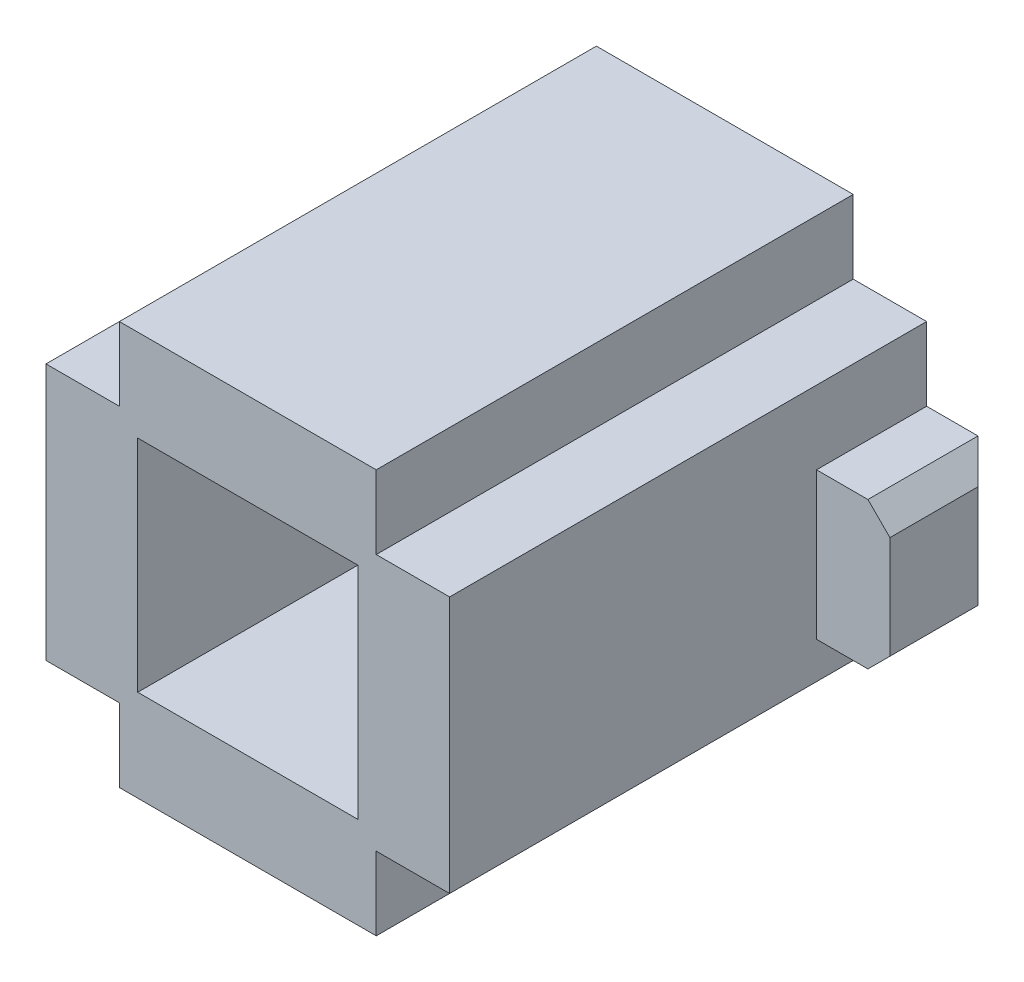
ISO-10303-21;
HEADER;
FILE_DESCRIPTION(('STEP AP214'),'2;1');
FILE_NAME('part.step','',(''),(''),'','','');
FILE_SCHEMA(('AUTOMOTIVE_DESIGN { 1 0 10303 214 1 1 1 1 }'));
ENDSEC;
DATA;
#1=APPLICATION_CONTEXT('core data for automotive mechanical design processes');
#2=APPLICATION_PROTOCOL_DEFINITION('international standard','automotive_design',2000,#1);
#3=PRODUCT_CONTEXT('',#1,'mechanical');
#4=PRODUCT('Part','Part','',(#3));
#5=PRODUCT_RELATED_PRODUCT_CATEGORY('part','',(#4));
#6=PRODUCT_DEFINITION_FORMATION('','',#4);
#7=PRODUCT_DEFINITION_CONTEXT('part definition',#1,'design');
#8=PRODUCT_DEFINITION('design','',#6,#7);
#9=PRODUCT_DEFINITION_SHAPE('','',#8);
#10=(LENGTH_UNIT() NAMED_UNIT(*) SI_UNIT(.MILLI.,.METRE.));
#11=(NAMED_UNIT(*) PLANE_ANGLE_UNIT() SI_UNIT($,.RADIAN.));
#12=(NAMED_UNIT(*) SI_UNIT($,.STERADIAN.) SOLID_ANGLE_UNIT());
#13=UNCERTAINTY_MEASURE_WITH_UNIT(LENGTH_MEASURE(1.E-05),#10,'distance_accuracy_value','');
#14=(GEOMETRIC_REPRESENTATION_CONTEXT(3) GLOBAL_UNCERTAINTY_ASSIGNED_CONTEXT((#13)) GLOBAL_UNIT_ASSIGNED_CONTEXT((#10,
#11,#12)) REPRESENTATION_CONTEXT('',''));
#15=CARTESIAN_POINT('',(0.,0.,0.));
#16=DIRECTION('',(0.,0.,1.));
#17=DIRECTION('',(1.,0.,0.));
#18=AXIS2_PLACEMENT_3D('',#15,#16,#17);
#19=CARTESIAN_POINT('',(27.5,17.5,32.5));
#20=DIRECTION('',(-1.,0.,0.));
#21=DIRECTION('',(0.,-1.,0.));
#22=AXIS2_PLACEMENT_3D('',#19,#20,#21);
#23=PLANE('',#22);
#24=DIRECTION('',(0.,0.,-1.));
#25=VECTOR('',#24,1.);
#26=CARTESIAN_POINT('',(27.5,-12.5,-32.5));
#27=LINE('',#26,#25);
#28=CARTESIAN_POINT('',(27.5,-12.5,-17.5));
#29=VERTEX_POINT('',#28);
#30=CARTESIAN_POINT('',(27.5,-12.5,-32.5));
#31=VERTEX_POINT('',#30);
#32=EDGE_CURVE('E197',#29,#31,#27,.T.);
#33=ORIENTED_EDGE('',*,*,#32,.F.);
#34=DIRECTION('',(0.,-1.,0.));
#35=VECTOR('',#34,1.);
#36=CARTESIAN_POINT('',(27.5,7.50000000000001,-17.5));
#37=LINE('',#36,#35);
#38=CARTESIAN_POINT('',(27.5,7.50000000000001,-17.5));
#39=VERTEX_POINT('',#38);
#40=EDGE_CURVE('E185',#39,#29,#37,.T.);
#41=ORIENTED_EDGE('',*,*,#40,.F.);
#42=DIRECTION('',(0.,0.,1.));
#43=VECTOR('',#42,1.);
#44=CARTESIAN_POINT('',(27.5,7.50000000000001,-32.5));
#45=LINE('',#44,#43);
#46=CARTESIAN_POINT('',(27.5,7.50000000000001,-32.5));
#47=VERTEX_POINT('',#46);
#48=EDGE_CURVE('E193',#47,#39,#45,.T.);
#49=ORIENTED_EDGE('',*,*,#48,.F.);
#50=DIRECTION('',(0.,1.,0.));
#51=VECTOR('',#50,1.);
#52=CARTESIAN_POINT('',(27.5,17.5,-32.5));
#53=LINE('',#52,#51);
#54=CARTESIAN_POINT('',(27.5,17.5,-32.5));
#55=VERTEX_POINT('',#54);
#56=EDGE_CURVE('E286',#47,#55,#53,.T.);
#57=ORIENTED_EDGE('',*,*,#56,.T.);
#58=DIRECTION('',(0.,0.,-1.));
#59=VECTOR('',#58,1.);
#60=CARTESIAN_POINT('',(27.5,17.5,32.5));
#61=LINE('',#60,#59);
#62=CARTESIAN_POINT('',(27.5,17.5,32.5));
#63=VERTEX_POINT('',#62);
#64=EDGE_CURVE('E302',#63,#55,#61,.T.);
#65=ORIENTED_EDGE('',*,*,#64,.F.);
#66=DIRECTION('',(0.,1.,0.));
#67=VECTOR('',#66,1.);
#68=CARTESIAN_POINT('',(27.5,17.5,32.5));
#69=LINE('',#68,#67);
#70=CARTESIAN_POINT('',(27.5,-17.5,32.5));
#71=VERTEX_POINT('',#70);
#72=EDGE_CURVE('E261',#71,#63,#69,.T.);
#73=ORIENTED_EDGE('',*,*,#72,.F.);
#74=DIRECTION('',(0.,0.,-1.));
#75=VECTOR('',#74,1.);
#76=CARTESIAN_POINT('',(27.5,-17.5,32.5));
#77=LINE('',#76,#75);
#78=CARTESIAN_POINT('',(27.5,-17.5,-32.5));
#79=VERTEX_POINT('',#78);
#80=EDGE_CURVE('E305',#71,#79,#77,.T.);
#81=ORIENTED_EDGE('',*,*,#80,.T.);
#82=EDGE_CURVE('E287',#79,#31,#53,.T.);
#83=ORIENTED_EDGE('',*,*,#82,.T.);
#84=EDGE_LOOP('',(#33,#41,#49,#57,#65,#73,#81,#83));
#85=FACE_BOUND('',#84,.T.);
#86=ADVANCED_FACE('F33',(#85),#23,.F.);
#87=CARTESIAN_POINT('',(0.,0.,32.5));
#88=DIRECTION('',(0.,0.,-1.));
#89=DIRECTION('',(-1.,0.,0.));
#90=AXIS2_PLACEMENT_3D('',#87,#88,#89);
#91=PLANE('',#90);
#92=DIRECTION('',(0.,-1.,0.));
#93=VECTOR('',#92,1.);
#94=CARTESIAN_POINT('',(-17.5,27.5,32.5));
#95=LINE('',#94,#93);
#96=CARTESIAN_POINT('',(-17.5,27.5,32.5));
#97=VERTEX_POINT('',#96);
#98=CARTESIAN_POINT('',(-17.5,17.5,32.5));
#99=VERTEX_POINT('',#98);
#100=EDGE_CURVE('E243',#97,#99,#95,.T.);
#101=ORIENTED_EDGE('',*,*,#100,.T.);
#102=DIRECTION('',(-1.,0.,0.));
#103=VECTOR('',#102,1.);
#104=CARTESIAN_POINT('',(-17.5,17.5,32.5));
#105=LINE('',#104,#103);
#106=CARTESIAN_POINT('',(-27.5,17.5,32.5));
#107=VERTEX_POINT('',#106);
#108=EDGE_CURVE('E246',#99,#107,#105,.T.);
#109=ORIENTED_EDGE('',*,*,#108,.T.);
#110=DIRECTION('',(0.,-1.,0.));
#111=VECTOR('',#110,1.);
#112=CARTESIAN_POINT('',(-27.5,17.5,32.5));
#113=LINE('',#112,#111);
#114=CARTESIAN_POINT('',(-27.5,-17.5,32.5));
#115=VERTEX_POINT('',#114);
#116=EDGE_CURVE('E249',#107,#115,#113,.T.);
#117=ORIENTED_EDGE('',*,*,#116,.T.);
#118=DIRECTION('',(1.,0.,0.));
#119=VECTOR('',#118,1.);
#120=CARTESIAN_POINT('',(-27.5,-17.5,32.5));
#121=LINE('',#120,#119);
#122=CARTESIAN_POINT('',(-17.5,-17.5,32.5));
#123=VERTEX_POINT('',#122);
#124=EDGE_CURVE('E251',#115,#123,#121,.T.);
#125=ORIENTED_EDGE('',*,*,#124,.T.);
#126=DIRECTION('',(0.,-1.,0.));
#127=VECTOR('',#126,1.);
#128=CARTESIAN_POINT('',(-17.5,-17.5,32.5));
#129=LINE('',#128,#127);
#130=CARTESIAN_POINT('',(-17.5,-27.5,32.5));
#131=VERTEX_POINT('',#130);
#132=EDGE_CURVE('E253',#123,#131,#129,.T.);
#133=ORIENTED_EDGE('',*,*,#132,.T.);
#134=DIRECTION('',(1.,0.,0.));
#135=VECTOR('',#134,1.);
#136=CARTESIAN_POINT('',(-17.5,-27.5,32.5));
#137=LINE('',#136,#135);
#138=CARTESIAN_POINT('',(17.5,-27.5,32.5));
#139=VERTEX_POINT('',#138);
#140=EDGE_CURVE('E255',#131,#139,#137,.T.);
#141=ORIENTED_EDGE('',*,*,#140,.T.);
#142=DIRECTION('',(0.,1.,0.));
#143=VECTOR('',#142,1.);
#144=CARTESIAN_POINT('',(17.5,-17.5,32.5));
#145=LINE('',#144,#143);
#146=CARTESIAN_POINT('',(17.5,-17.5,32.5));
#147=VERTEX_POINT('',#146);
#148=EDGE_CURVE('E257',#139,#147,#145,.T.);
#149=ORIENTED_EDGE('',*,*,#148,.T.);
#150=DIRECTION('',(1.,0.,0.));
#151=VECTOR('',#150,1.);
#152=CARTESIAN_POINT('',(27.5,-17.5,32.5));
#153=LINE('',#152,#151);
#154=EDGE_CURVE('E259',#147,#71,#153,.T.);
#155=ORIENTED_EDGE('',*,*,#154,.T.);
#156=ORIENTED_EDGE('',*,*,#72,.T.);
#157=DIRECTION('',(-1.,0.,0.));
#158=VECTOR('',#157,1.);
#159=CARTESIAN_POINT('',(17.5,17.5,32.5));
#160=LINE('',#159,#158);
#161=CARTESIAN_POINT('',(17.5,17.5,32.5));
#162=VERTEX_POINT('',#161);
#163=EDGE_CURVE('E263',#63,#162,#160,.T.);
#164=ORIENTED_EDGE('',*,*,#163,.T.);
#165=DIRECTION('',(0.,1.,0.));
#166=VECTOR('',#165,1.);
#167=CARTESIAN_POINT('',(17.5,27.5,32.5));
#168=LINE('',#167,#166);
#169=CARTESIAN_POINT('',(17.5,27.5,32.5));
#170=VERTEX_POINT('',#169);
#171=EDGE_CURVE('E265',#162,#170,#168,.T.);
#172=ORIENTED_EDGE('',*,*,#171,.T.);
#173=DIRECTION('',(-1.,0.,0.));
#174=VECTOR('',#173,1.);
#175=CARTESIAN_POINT('',(-17.5,27.5,32.5));
#176=LINE('',#175,#174);
#177=EDGE_CURVE('E267',#170,#97,#176,.T.);
#178=ORIENTED_EDGE('',*,*,#177,.T.);
#179=EDGE_LOOP('',(#101,#109,#117,#125,#133,#141,#149,#155,#156,#164,#172,#178));
#180=FACE_BOUND('',#179,.T.);
#181=DIRECTION('',(0.,-1.,0.));
#182=VECTOR('',#181,1.);
#183=CARTESIAN_POINT('',(-15.,15.,32.5));
#184=LINE('',#183,#182);
#185=CARTESIAN_POINT('',(-15.,15.,32.5));
#186=VERTEX_POINT('',#185);
#187=CARTESIAN_POINT('',(-15.,-15.,32.5));
#188=VERTEX_POINT('',#187);
#189=EDGE_CURVE('E212',#186,#188,#184,.T.);
#190=ORIENTED_EDGE('',*,*,#189,.F.);
#191=DIRECTION('',(-1.,0.,0.));
#192=VECTOR('',#191,1.);
#193=CARTESIAN_POINT('',(-15.,15.,32.5));
#194=LINE('',#193,#192);
#195=CARTESIAN_POINT('',(15.,15.,32.5));
#196=VERTEX_POINT('',#195);
#197=EDGE_CURVE('E220',#196,#186,#194,.T.);
#198=ORIENTED_EDGE('',*,*,#197,.F.);
#199=DIRECTION('',(0.,1.,0.));
#200=VECTOR('',#199,1.);
#201=CARTESIAN_POINT('',(15.,15.,32.5));
#202=LINE('',#201,#200);
#203=CARTESIAN_POINT('',(15.,-15.,32.5));
#204=VERTEX_POINT('',#203);
#205=EDGE_CURVE('E217',#204,#196,#202,.T.);
#206=ORIENTED_EDGE('',*,*,#205,.F.);
#207=DIRECTION('',(1.,0.,0.));
#208=VECTOR('',#207,1.);
#209=CARTESIAN_POINT('',(-15.,-15.,32.5));
#210=LINE('',#209,#208);
#211=EDGE_CURVE('E214',#188,#204,#210,.T.);
#212=ORIENTED_EDGE('',*,*,#211,.F.);
#213=EDGE_LOOP('',(#190,#198,#206,#212));
#214=FACE_BOUND('',#213,.T.);
#215=ADVANCED_FACE('F373',(#180,#214),#91,.F.);
#216=CARTESIAN_POINT('',(0.,0.,-32.5));
#217=DIRECTION('',(0.,0.,-1.));
#218=DIRECTION('',(-1.,0.,0.));
#219=AXIS2_PLACEMENT_3D('',#216,#217,#218);
#220=PLANE('',#219);
#221=DIRECTION('',(-1.,0.,0.));
#222=VECTOR('',#221,1.);
#223=CARTESIAN_POINT('',(37.5,7.50000000000001,-32.5));
#224=LINE('',#223,#222);
#225=CARTESIAN_POINT('',(34.5,7.50000000000001,-32.5));
#226=VERTEX_POINT('',#225);
#227=EDGE_CURVE('E187',#226,#47,#224,.T.);
#228=ORIENTED_EDGE('',*,*,#227,.F.);
#229=DIRECTION('',(0.,-1.,0.));
#230=VECTOR('',#229,1.);
#231=CARTESIAN_POINT('',(34.5,-12.5,-32.5));
#232=LINE('',#231,#230);
#233=CARTESIAN_POINT('',(34.5,-12.5,-32.5));
#234=VERTEX_POINT('',#233);
#235=EDGE_CURVE('E42',#226,#234,#232,.T.);
#236=ORIENTED_EDGE('',*,*,#235,.T.);
#237=DIRECTION('',(-1.,0.,0.));
#238=VECTOR('',#237,1.);
#239=CARTESIAN_POINT('',(37.5,-12.5,-32.5));
#240=LINE('',#239,#238);
#241=EDGE_CURVE('E207',#234,#31,#240,.T.);
#242=ORIENTED_EDGE('',*,*,#241,.T.);
#243=ORIENTED_EDGE('',*,*,#82,.F.);
#244=DIRECTION('',(1.,0.,0.));
#245=VECTOR('',#244,1.);
#246=CARTESIAN_POINT('',(27.5,-17.5,-32.5));
#247=LINE('',#246,#245);
#248=CARTESIAN_POINT('',(17.5,-17.5,-32.5));
#249=VERTEX_POINT('',#248);
#250=EDGE_CURVE('E284',#249,#79,#247,.T.);
#251=ORIENTED_EDGE('',*,*,#250,.F.);
#252=DIRECTION('',(0.,1.,0.));
#253=VECTOR('',#252,1.);
#254=CARTESIAN_POINT('',(17.5,-17.5,-32.5));
#255=LINE('',#254,#253);
#256=CARTESIAN_POINT('',(17.5,-27.5,-32.5));
#257=VERTEX_POINT('',#256);
#258=EDGE_CURVE('E282',#257,#249,#255,.T.);
#259=ORIENTED_EDGE('',*,*,#258,.F.);
#260=DIRECTION('',(1.,0.,0.));
#261=VECTOR('',#260,1.);
#262=CARTESIAN_POINT('',(-17.5,-27.5,-32.5));
#263=LINE('',#262,#261);
#264=CARTESIAN_POINT('',(-17.5,-27.5,-32.5));
#265=VERTEX_POINT('',#264);
#266=EDGE_CURVE('E280',#265,#257,#263,.T.);
#267=ORIENTED_EDGE('',*,*,#266,.F.);
#268=DIRECTION('',(0.,-1.,0.));
#269=VECTOR('',#268,1.);
#270=CARTESIAN_POINT('',(-17.5,-17.5,-32.5));
#271=LINE('',#270,#269);
#272=CARTESIAN_POINT('',(-17.5,-17.5,-32.5));
#273=VERTEX_POINT('',#272);
#274=EDGE_CURVE('E278',#273,#265,#271,.T.);
#275=ORIENTED_EDGE('',*,*,#274,.F.);
#276=DIRECTION('',(1.,0.,0.));
#277=VECTOR('',#276,1.);
#278=CARTESIAN_POINT('',(-27.5,-17.5,-32.5));
#279=LINE('',#278,#277);
#280=CARTESIAN_POINT('',(-27.5,-17.5,-32.5));
#281=VERTEX_POINT('',#280);
#282=EDGE_CURVE('E276',#281,#273,#279,.T.);
#283=ORIENTED_EDGE('',*,*,#282,.F.);
#284=DIRECTION('',(0.,-1.,0.));
#285=VECTOR('',#284,1.);
#286=CARTESIAN_POINT('',(-27.5,17.5,-32.5));
#287=LINE('',#286,#285);
#288=CARTESIAN_POINT('',(-27.5,17.5,-32.5));
#289=VERTEX_POINT('',#288);
#290=EDGE_CURVE('E274',#289,#281,#287,.T.);
#291=ORIENTED_EDGE('',*,*,#290,.F.);
#292=DIRECTION('',(-1.,0.,0.));
#293=VECTOR('',#292,1.);
#294=CARTESIAN_POINT('',(-17.5,17.5,-32.5));
#295=LINE('',#294,#293);
#296=CARTESIAN_POINT('',(-17.5,17.5,-32.5));
#297=VERTEX_POINT('',#296);
#298=EDGE_CURVE('E272',#297,#289,#295,.T.);
#299=ORIENTED_EDGE('',*,*,#298,.F.);
#300=DIRECTION('',(0.,-1.,0.));
#301=VECTOR('',#300,1.);
#302=CARTESIAN_POINT('',(-17.5,27.5,-32.5));
#303=LINE('',#302,#301);
#304=CARTESIAN_POINT('',(-17.5,27.5,-32.5));
#305=VERTEX_POINT('',#304);
#306=EDGE_CURVE('E242',#305,#297,#303,.T.);
#307=ORIENTED_EDGE('',*,*,#306,.F.);
#308=DIRECTION('',(-1.,0.,0.));
#309=VECTOR('',#308,1.);
#310=CARTESIAN_POINT('',(-17.5,27.5,-32.5));
#311=LINE('',#310,#309);
#312=CARTESIAN_POINT('',(17.5,27.5,-32.5));
#313=VERTEX_POINT('',#312);
#314=EDGE_CURVE('E247',#313,#305,#311,.T.);
#315=ORIENTED_EDGE('',*,*,#314,.F.);
#316=DIRECTION('',(0.,1.,0.));
#317=VECTOR('',#316,1.);
#318=CARTESIAN_POINT('',(17.5,27.5,-32.5));
#319=LINE('',#318,#317);
#320=CARTESIAN_POINT('',(17.5,17.5,-32.5));
#321=VERTEX_POINT('',#320);
#322=EDGE_CURVE('E291',#321,#313,#319,.T.);
#323=ORIENTED_EDGE('',*,*,#322,.F.);
#324=DIRECTION('',(-1.,0.,0.));
#325=VECTOR('',#324,1.);
#326=CARTESIAN_POINT('',(17.5,17.5,-32.5));
#327=LINE('',#326,#325);
#328=EDGE_CURVE('E289',#55,#321,#327,.T.);
#329=ORIENTED_EDGE('',*,*,#328,.F.);
#330=ORIENTED_EDGE('',*,*,#56,.F.);
#331=EDGE_LOOP('',(#228,#236,#242,#243,#251,#259,#267,#275,#283,#291,#299,#307,#315,#323,#329,#330));
#332=FACE_BOUND('',#331,.T.);
#333=DIRECTION('',(-1.,0.,0.));
#334=VECTOR('',#333,1.);
#335=CARTESIAN_POINT('',(-15.,15.,-32.5));
#336=LINE('',#335,#334);
#337=CARTESIAN_POINT('',(15.,15.,-32.5));
#338=VERTEX_POINT('',#337);
#339=CARTESIAN_POINT('',(-15.,15.,-32.5));
#340=VERTEX_POINT('',#339);
#341=EDGE_CURVE('E215',#338,#340,#336,.T.);
#342=ORIENTED_EDGE('',*,*,#341,.T.);
#343=DIRECTION('',(0.,-1.,0.));
#344=VECTOR('',#343,1.);
#345=CARTESIAN_POINT('',(-15.,15.,-32.5));
#346=LINE('',#345,#344);
#347=CARTESIAN_POINT('',(-15.,-15.,-32.5));
#348=VERTEX_POINT('',#347);
#349=EDGE_CURVE('E211',#340,#348,#346,.T.);
#350=ORIENTED_EDGE('',*,*,#349,.T.);
#351=DIRECTION('',(1.,0.,0.));
#352=VECTOR('',#351,1.);
#353=CARTESIAN_POINT('',(-15.,-15.,-32.5));
#354=LINE('',#353,#352);
#355=CARTESIAN_POINT('',(15.,-15.,-32.5));
#356=VERTEX_POINT('',#355);
#357=EDGE_CURVE('E225',#348,#356,#354,.T.);
#358=ORIENTED_EDGE('',*,*,#357,.T.);
#359=DIRECTION('',(0.,1.,0.));
#360=VECTOR('',#359,1.);
#361=CARTESIAN_POINT('',(15.,15.,-32.5));
#362=LINE('',#361,#360);
#363=EDGE_CURVE('E228',#356,#338,#362,.T.);
#364=ORIENTED_EDGE('',*,*,#363,.T.);
#365=EDGE_LOOP('',(#342,#350,#358,#364));
#366=FACE_BOUND('',#365,.T.);
#367=ADVANCED_FACE('F359',(#332,#366),#220,.T.);
#368=CARTESIAN_POINT('',(-17.5,27.5,32.5));
#369=DIRECTION('',(1.,0.,0.));
#370=DIRECTION('',(0.,1.,0.));
#371=AXIS2_PLACEMENT_3D('',#368,#369,#370);
#372=PLANE('',#371);
#373=ORIENTED_EDGE('',*,*,#306,.T.);
#374=DIRECTION('',(0.,0.,-1.));
#375=VECTOR('',#374,1.);
#376=CARTESIAN_POINT('',(-17.5,17.5,32.5));
#377=LINE('',#376,#375);
#378=EDGE_CURVE('E326',#99,#297,#377,.T.);
#379=ORIENTED_EDGE('',*,*,#378,.F.);
#380=ORIENTED_EDGE('',*,*,#100,.F.);
#381=DIRECTION('',(0.,0.,-1.));
#382=VECTOR('',#381,1.);
#383=CARTESIAN_POINT('',(-17.5,27.5,32.5));
#384=LINE('',#383,#382);
#385=EDGE_CURVE('E269',#97,#305,#384,.T.);
#386=ORIENTED_EDGE('',*,*,#385,.T.);
#387=EDGE_LOOP('',(#373,#379,#380,#386));
#388=FACE_BOUND('',#387,.T.);
#389=ADVANCED_FACE('F413',(#388),#372,.F.);
#390=CARTESIAN_POINT('',(-17.5,17.5,32.5));
#391=DIRECTION('',(0.,-1.,0.));
#392=DIRECTION('',(0.,0.,-1.));
#393=AXIS2_PLACEMENT_3D('',#390,#391,#392);
#394=PLANE('',#393);
#395=ORIENTED_EDGE('',*,*,#298,.T.);
#396=DIRECTION('',(0.,0.,-1.));
#397=VECTOR('',#396,1.);
#398=CARTESIAN_POINT('',(-27.5,17.5,32.5));
#399=LINE('',#398,#397);
#400=EDGE_CURVE('E323',#107,#289,#399,.T.);
#401=ORIENTED_EDGE('',*,*,#400,.F.);
#402=ORIENTED_EDGE('',*,*,#108,.F.);
#403=ORIENTED_EDGE('',*,*,#378,.T.);
#404=EDGE_LOOP('',(#395,#401,#402,#403));
#405=FACE_BOUND('',#404,.T.);
#406=ADVANCED_FACE('F409',(#405),#394,.F.);
#407=CARTESIAN_POINT('',(-27.5,17.5,32.5));
#408=DIRECTION('',(1.,0.,0.));
#409=DIRECTION('',(0.,1.,0.));
#410=AXIS2_PLACEMENT_3D('',#407,#408,#409);
#411=PLANE('',#410);
#412=ORIENTED_EDGE('',*,*,#290,.T.);
#413=DIRECTION('',(0.,0.,-1.));
#414=VECTOR('',#413,1.);
#415=CARTESIAN_POINT('',(-27.5,-17.5,32.5));
#416=LINE('',#415,#414);
#417=EDGE_CURVE('E320',#115,#281,#416,.T.);
#418=ORIENTED_EDGE('',*,*,#417,.F.);
#419=ORIENTED_EDGE('',*,*,#116,.F.);
#420=ORIENTED_EDGE('',*,*,#400,.T.);
#421=EDGE_LOOP('',(#412,#418,#419,#420));
#422=FACE_BOUND('',#421,.T.);
#423=ADVANCED_FACE('F405',(#422),#411,.F.);
#424=CARTESIAN_POINT('',(-27.5,-17.5,32.5));
#425=DIRECTION('',(0.,1.,0.));
#426=DIRECTION('',(0.,0.,1.));
#427=AXIS2_PLACEMENT_3D('',#424,#425,#426);
#428=PLANE('',#427);
#429=ORIENTED_EDGE('',*,*,#282,.T.);
#430=DIRECTION('',(0.,0.,-1.));
#431=VECTOR('',#430,1.);
#432=CARTESIAN_POINT('',(-17.5,-17.5,32.5));
#433=LINE('',#432,#431);
#434=EDGE_CURVE('E317',#123,#273,#433,.T.);
#435=ORIENTED_EDGE('',*,*,#434,.F.);
#436=ORIENTED_EDGE('',*,*,#124,.F.);
#437=ORIENTED_EDGE('',*,*,#417,.T.);
#438=EDGE_LOOP('',(#429,#435,#436,#437));
#439=FACE_BOUND('',#438,.T.);
#440=ADVANCED_FACE('F401',(#439),#428,.F.);
#441=CARTESIAN_POINT('',(-17.5,-17.5,32.5));
#442=DIRECTION('',(1.,0.,0.));
#443=DIRECTION('',(0.,0.,-1.));
#444=AXIS2_PLACEMENT_3D('',#441,#442,#443);
#445=PLANE('',#444);
#446=ORIENTED_EDGE('',*,*,#274,.T.);
#447=DIRECTION('',(0.,0.,-1.));
#448=VECTOR('',#447,1.);
#449=CARTESIAN_POINT('',(-17.5,-27.5,32.5));
#450=LINE('',#449,#448);
#451=EDGE_CURVE('E314',#131,#265,#450,.T.);
#452=ORIENTED_EDGE('',*,*,#451,.F.);
#453=ORIENTED_EDGE('',*,*,#132,.F.);
#454=ORIENTED_EDGE('',*,*,#434,.T.);
#455=EDGE_LOOP('',(#446,#452,#453,#454));
#456=FACE_BOUND('',#455,.T.);
#457=ADVANCED_FACE('F397',(#456),#445,.F.);
#458=CARTESIAN_POINT('',(-17.5,-27.5,32.5));
#459=DIRECTION('',(0.,1.,0.));
#460=DIRECTION('',(0.,0.,1.));
#461=AXIS2_PLACEMENT_3D('',#458,#459,#460);
#462=PLANE('',#461);
#463=ORIENTED_EDGE('',*,*,#266,.T.);
#464=DIRECTION('',(0.,0.,-1.));
#465=VECTOR('',#464,1.);
#466=CARTESIAN_POINT('',(17.5,-27.5,32.5));
#467=LINE('',#466,#465);
#468=EDGE_CURVE('E311',#139,#257,#467,.T.);
#469=ORIENTED_EDGE('',*,*,#468,.F.);
#470=ORIENTED_EDGE('',*,*,#140,.F.);
#471=ORIENTED_EDGE('',*,*,#451,.T.);
#472=EDGE_LOOP('',(#463,#469,#470,#471));
#473=FACE_BOUND('',#472,.T.);
#474=ADVANCED_FACE('F393',(#473),#462,.F.);
#475=CARTESIAN_POINT('',(17.5,-17.5,32.5));
#476=DIRECTION('',(-1.,0.,0.));
#477=DIRECTION('',(0.,0.,1.));
#478=AXIS2_PLACEMENT_3D('',#475,#476,#477);
#479=PLANE('',#478);
#480=ORIENTED_EDGE('',*,*,#258,.T.);
#481=DIRECTION('',(0.,0.,-1.));
#482=VECTOR('',#481,1.);
#483=CARTESIAN_POINT('',(17.5,-17.5,32.5));
#484=LINE('',#483,#482);
#485=EDGE_CURVE('E308',#147,#249,#484,.T.);
#486=ORIENTED_EDGE('',*,*,#485,.F.);
#487=ORIENTED_EDGE('',*,*,#148,.F.);
#488=ORIENTED_EDGE('',*,*,#468,.T.);
#489=EDGE_LOOP('',(#480,#486,#487,#488));
#490=FACE_BOUND('',#489,.T.);
#491=ADVANCED_FACE('F389',(#490),#479,.F.);
#492=CARTESIAN_POINT('',(27.5,-17.5,32.5));
#493=DIRECTION('',(0.,1.,0.));
#494=DIRECTION('',(0.,0.,1.));
#495=AXIS2_PLACEMENT_3D('',#492,#493,#494);
#496=PLANE('',#495);
#497=ORIENTED_EDGE('',*,*,#250,.T.);
#498=ORIENTED_EDGE('',*,*,#80,.F.);
#499=ORIENTED_EDGE('',*,*,#154,.F.);
#500=ORIENTED_EDGE('',*,*,#485,.T.);
#501=EDGE_LOOP('',(#497,#498,#499,#500));
#502=FACE_BOUND('',#501,.T.);
#503=ADVANCED_FACE('F386',(#502),#496,.F.);
#504=CARTESIAN_POINT('',(17.5,17.5,32.5));
#505=DIRECTION('',(0.,-1.,0.));
#506=DIRECTION('',(0.,0.,-1.));
#507=AXIS2_PLACEMENT_3D('',#504,#505,#506);
#508=PLANE('',#507);
#509=ORIENTED_EDGE('',*,*,#328,.T.);
#510=DIRECTION('',(0.,0.,-1.));
#511=VECTOR('',#510,1.);
#512=CARTESIAN_POINT('',(17.5,17.5,32.5));
#513=LINE('',#512,#511);
#514=EDGE_CURVE('E299',#162,#321,#513,.T.);
#515=ORIENTED_EDGE('',*,*,#514,.F.);
#516=ORIENTED_EDGE('',*,*,#163,.F.);
#517=ORIENTED_EDGE('',*,*,#64,.T.);
#518=EDGE_LOOP('',(#509,#515,#516,#517));
#519=FACE_BOUND('',#518,.T.);
#520=ADVANCED_FACE('F384',(#519),#508,.F.);
#521=CARTESIAN_POINT('',(17.5,27.5,32.5));
#522=DIRECTION('',(-1.,0.,0.));
#523=DIRECTION('',(0.,0.,1.));
#524=AXIS2_PLACEMENT_3D('',#521,#522,#523);
#525=PLANE('',#524);
#526=ORIENTED_EDGE('',*,*,#322,.T.);
#527=DIRECTION('',(0.,0.,-1.));
#528=VECTOR('',#527,1.);
#529=CARTESIAN_POINT('',(17.5,27.5,32.5));
#530=LINE('',#529,#528);
#531=EDGE_CURVE('E296',#170,#313,#530,.T.);
#532=ORIENTED_EDGE('',*,*,#531,.F.);
#533=ORIENTED_EDGE('',*,*,#171,.F.);
#534=ORIENTED_EDGE('',*,*,#514,.T.);
#535=EDGE_LOOP('',(#526,#532,#533,#534));
#536=FACE_BOUND('',#535,.T.);
#537=ADVANCED_FACE('F499',(#536),#525,.F.);
#538=CARTESIAN_POINT('',(-17.5,27.5,32.5));
#539=DIRECTION('',(0.,-1.,0.));
#540=DIRECTION('',(0.,0.,-1.));
#541=AXIS2_PLACEMENT_3D('',#538,#539,#540);
#542=PLANE('',#541);
#543=ORIENTED_EDGE('',*,*,#314,.T.);
#544=ORIENTED_EDGE('',*,*,#385,.F.);
#545=ORIENTED_EDGE('',*,*,#177,.F.);
#546=ORIENTED_EDGE('',*,*,#531,.T.);
#547=EDGE_LOOP('',(#543,#544,#545,#546));
#548=FACE_BOUND('',#547,.T.);
#549=ADVANCED_FACE('F491',(#548),#542,.F.);
#550=CARTESIAN_POINT('',(-15.,15.,32.5));
#551=DIRECTION('',(1.,0.,0.));
#552=DIRECTION('',(0.,1.,0.));
#553=AXIS2_PLACEMENT_3D('',#550,#551,#552);
#554=PLANE('',#553);
#555=ORIENTED_EDGE('',*,*,#349,.F.);
#556=DIRECTION('',(0.,0.,-1.));
#557=VECTOR('',#556,1.);
#558=CARTESIAN_POINT('',(-15.,15.,32.5));
#559=LINE('',#558,#557);
#560=EDGE_CURVE('E222',#186,#340,#559,.T.);
#561=ORIENTED_EDGE('',*,*,#560,.F.);
#562=ORIENTED_EDGE('',*,*,#189,.T.);
#563=DIRECTION('',(0.,0.,-1.));
#564=VECTOR('',#563,1.);
#565=CARTESIAN_POINT('',(-15.,-15.,32.5));
#566=LINE('',#565,#564);
#567=EDGE_CURVE('E239',#188,#348,#566,.T.);
#568=ORIENTED_EDGE('',*,*,#567,.T.);
#569=EDGE_LOOP('',(#555,#561,#562,#568));
#570=FACE_BOUND('',#569,.T.);
#571=ADVANCED_FACE('F483',(#570),#554,.T.);
#572=CARTESIAN_POINT('',(-15.,-15.,32.5));
#573=DIRECTION('',(0.,1.,0.));
#574=DIRECTION('',(0.,0.,1.));
#575=AXIS2_PLACEMENT_3D('',#572,#573,#574);
#576=PLANE('',#575);
#577=ORIENTED_EDGE('',*,*,#357,.F.);
#578=ORIENTED_EDGE('',*,*,#567,.F.);
#579=ORIENTED_EDGE('',*,*,#211,.T.);
#580=DIRECTION('',(0.,0.,-1.));
#581=VECTOR('',#580,1.);
#582=CARTESIAN_POINT('',(15.,-15.,32.5));
#583=LINE('',#582,#581);
#584=EDGE_CURVE('E237',#204,#356,#583,.T.);
#585=ORIENTED_EDGE('',*,*,#584,.T.);
#586=EDGE_LOOP('',(#577,#578,#579,#585));
#587=FACE_BOUND('',#586,.T.);
#588=ADVANCED_FACE('F475',(#587),#576,.T.);
#589=CARTESIAN_POINT('',(15.,15.,32.5));
#590=DIRECTION('',(-1.,0.,0.));
#591=DIRECTION('',(0.,-1.,0.));
#592=AXIS2_PLACEMENT_3D('',#589,#590,#591);
#593=PLANE('',#592);
#594=ORIENTED_EDGE('',*,*,#363,.F.);
#595=ORIENTED_EDGE('',*,*,#584,.F.);
#596=ORIENTED_EDGE('',*,*,#205,.T.);
#597=DIRECTION('',(0.,0.,-1.));
#598=VECTOR('',#597,1.);
#599=CARTESIAN_POINT('',(15.,15.,32.5));
#600=LINE('',#599,#598);
#601=EDGE_CURVE('E235',#196,#338,#600,.T.);
#602=ORIENTED_EDGE('',*,*,#601,.T.);
#603=EDGE_LOOP('',(#594,#595,#596,#602));
#604=FACE_BOUND('',#603,.T.);
#605=ADVANCED_FACE('F468',(#604),#593,.T.);
#606=CARTESIAN_POINT('',(-15.,15.,32.5));
#607=DIRECTION('',(0.,-1.,0.));
#608=DIRECTION('',(0.,0.,-1.));
#609=AXIS2_PLACEMENT_3D('',#606,#607,#608);
#610=PLANE('',#609);
#611=ORIENTED_EDGE('',*,*,#341,.F.);
#612=ORIENTED_EDGE('',*,*,#601,.F.);
#613=ORIENTED_EDGE('',*,*,#197,.T.);
#614=ORIENTED_EDGE('',*,*,#560,.T.);
#615=EDGE_LOOP('',(#611,#612,#613,#614));
#616=FACE_BOUND('',#615,.T.);
#617=ADVANCED_FACE('F447',(#616),#610,.T.);
#618=CARTESIAN_POINT('',(37.5,7.50000000000001,-32.5));
#619=DIRECTION('',(0.,-1.,0.));
#620=DIRECTION('',(1.,0.,0.));
#621=AXIS2_PLACEMENT_3D('',#618,#619,#620);
#622=PLANE('',#621);
#623=DIRECTION('',(-1.,0.,0.));
#624=VECTOR('',#623,1.);
#625=CARTESIAN_POINT('',(37.5,7.50000000000001,-17.5));
#626=LINE('',#625,#624);
#627=CARTESIAN_POINT('',(34.5,7.50000000000001,-17.5));
#628=VERTEX_POINT('',#627);
#629=EDGE_CURVE('E181',#628,#39,#626,.T.);
#630=ORIENTED_EDGE('',*,*,#629,.F.);
#631=DIRECTION('',(0.,0.,-1.));
#632=VECTOR('',#631,1.);
#633=CARTESIAN_POINT('',(34.5,7.50000000000001,-32.5));
#634=LINE('',#633,#632);
#635=EDGE_CURVE('E11',#628,#226,#634,.T.);
#636=ORIENTED_EDGE('',*,*,#635,.T.);
#637=ORIENTED_EDGE('',*,*,#227,.T.);
#638=ORIENTED_EDGE('',*,*,#48,.T.);
#639=EDGE_LOOP('',(#630,#636,#637,#638));
#640=FACE_BOUND('',#639,.T.);
#641=ADVANCED_FACE('F199',(#640),#622,.F.);
#642=CARTESIAN_POINT('',(37.5,7.50000000000001,-17.5));
#643=DIRECTION('',(0.,0.,-1.));
#644=DIRECTION('',(0.,1.,0.));
#645=AXIS2_PLACEMENT_3D('',#642,#643,#644);
#646=PLANE('',#645);
#647=DIRECTION('',(-1.,0.,0.));
#648=VECTOR('',#647,1.);
#649=CARTESIAN_POINT('',(37.5,-12.5,-17.5));
#650=LINE('',#649,#648);
#651=CARTESIAN_POINT('',(34.5,-12.5,-17.5));
#652=VERTEX_POINT('',#651);
#653=EDGE_CURVE('E188',#652,#29,#650,.T.);
#654=ORIENTED_EDGE('',*,*,#653,.F.);
#655=DIRECTION('',(-0.707106781186551,-0.707106781186544,0.));
#656=VECTOR('',#655,1.);
#657=CARTESIAN_POINT('',(37.5,-9.5,-17.5));
#658=LINE('',#657,#656);
#659=CARTESIAN_POINT('',(37.5,-9.5,-17.5));
#660=VERTEX_POINT('',#659);
#661=EDGE_CURVE('E339',#652,#660,#658,.F.);
#662=ORIENTED_EDGE('',*,*,#661,.T.);
#663=DIRECTION('',(0.,-1.,0.));
#664=VECTOR('',#663,1.);
#665=CARTESIAN_POINT('',(37.5,7.50000000000001,-17.5));
#666=LINE('',#665,#664);
#667=CARTESIAN_POINT('',(37.5,4.50000000000002,-17.5));
#668=VERTEX_POINT('',#667);
#669=EDGE_CURVE('E204',#668,#660,#666,.T.);
#670=ORIENTED_EDGE('',*,*,#669,.F.);
#671=DIRECTION('',(0.707106781186551,-0.707106781186544,0.));
#672=VECTOR('',#671,1.);
#673=CARTESIAN_POINT('',(37.5,4.50000000000002,-17.5));
#674=LINE('',#673,#672);
#675=EDGE_CURVE('E56',#668,#628,#674,.F.);
#676=ORIENTED_EDGE('',*,*,#675,.T.);
#677=ORIENTED_EDGE('',*,*,#629,.T.);
#678=ORIENTED_EDGE('',*,*,#40,.T.);
#679=EDGE_LOOP('',(#654,#662,#670,#676,#677,#678));
#680=FACE_BOUND('',#679,.T.);
#681=ADVANCED_FACE('F184',(#680),#646,.F.);
#682=CARTESIAN_POINT('',(37.5,-12.5,-32.5));
#683=DIRECTION('',(0.,1.,0.));
#684=DIRECTION('',(-1.,0.,0.));
#685=AXIS2_PLACEMENT_3D('',#682,#683,#684);
#686=PLANE('',#685);
#687=ORIENTED_EDGE('',*,*,#241,.F.);
#688=DIRECTION('',(0.,0.,1.));
#689=VECTOR('',#688,1.);
#690=CARTESIAN_POINT('',(34.5,-12.5,-32.5));
#691=LINE('',#690,#689);
#692=EDGE_CURVE('E336',#234,#652,#691,.T.);
#693=ORIENTED_EDGE('',*,*,#692,.T.);
#694=ORIENTED_EDGE('',*,*,#653,.T.);
#695=ORIENTED_EDGE('',*,*,#32,.T.);
#696=EDGE_LOOP('',(#687,#693,#694,#695));
#697=FACE_BOUND('',#696,.T.);
#698=ADVANCED_FACE('F363',(#697),#686,.F.);
#699=CARTESIAN_POINT('',(37.5,0.,0.));
#700=DIRECTION('',(-1.,0.,0.));
#701=DIRECTION('',(0.,-1.,0.));
#702=AXIS2_PLACEMENT_3D('',#699,#700,#701);
#703=PLANE('',#702);
#704=ORIENTED_EDGE('',*,*,#669,.T.);
#705=DIRECTION('',(0.,0.,-1.));
#706=VECTOR('',#705,1.);
#707=CARTESIAN_POINT('',(37.5,-9.5,0.));
#708=LINE('',#707,#706);
#709=CARTESIAN_POINT('',(37.5,-9.5,-29.5));
#710=VERTEX_POINT('',#709);
#711=EDGE_CURVE('E333',#660,#710,#708,.T.);
#712=ORIENTED_EDGE('',*,*,#711,.T.);
#713=DIRECTION('',(0.,1.,0.));
#714=VECTOR('',#713,1.);
#715=CARTESIAN_POINT('',(37.5,7.50000000000001,-29.5));
#716=LINE('',#715,#714);
#717=CARTESIAN_POINT('',(37.5,4.50000000000002,-29.5));
#718=VERTEX_POINT('',#717);
#719=EDGE_CURVE('E331',#710,#718,#716,.T.);
#720=ORIENTED_EDGE('',*,*,#719,.T.);
#721=DIRECTION('',(0.,0.,1.));
#722=VECTOR('',#721,1.);
#723=CARTESIAN_POINT('',(37.5,4.50000000000002,0.));
#724=LINE('',#723,#722);
#725=EDGE_CURVE('E329',#718,#668,#724,.T.);
#726=ORIENTED_EDGE('',*,*,#725,.T.);
#727=EDGE_LOOP('',(#704,#712,#720,#726));
#728=FACE_BOUND('',#727,.T.);
#729=ADVANCED_FACE('F355',(#728),#703,.F.);
#730=CARTESIAN_POINT('',(37.5,4.50000000000002,0.));
#731=DIRECTION('',(-0.707106781186544,-0.707106781186551,0.));
#732=DIRECTION('',(0.,0.,1.));
#733=AXIS2_PLACEMENT_3D('',#730,#731,#732);
#734=PLANE('',#733);
#735=ORIENTED_EDGE('',*,*,#675,.F.);
#736=ORIENTED_EDGE('',*,*,#725,.F.);
#737=DIRECTION('',(0.577350269189629,-0.577350269189624,0.577350269189624));
#738=VECTOR('',#737,1.);
#739=CARTESIAN_POINT('',(47.3333333333334,-5.33333333333326,-19.6666666666667));
#740=LINE('',#739,#738);
#741=EDGE_CURVE('E37',#226,#718,#740,.T.);
#742=ORIENTED_EDGE('',*,*,#741,.F.);
#743=ORIENTED_EDGE('',*,*,#635,.F.);
#744=EDGE_LOOP('',(#735,#736,#742,#743));
#745=FACE_BOUND('',#744,.T.);
#746=ADVANCED_FACE('F35',(#745),#734,.F.);
#747=CARTESIAN_POINT('',(37.5,0.,-29.5));
#748=DIRECTION('',(0.707106781186544,0.,-0.707106781186551));
#749=DIRECTION('',(0.,-1.,0.));
#750=AXIS2_PLACEMENT_3D('',#747,#748,#749);
#751=PLANE('',#750);
#752=ORIENTED_EDGE('',*,*,#741,.T.);
#753=ORIENTED_EDGE('',*,*,#719,.F.);
#754=DIRECTION('',(0.57735026918963,0.577350269189624,0.577350269189624));
#755=VECTOR('',#754,1.);
#756=CARTESIAN_POINT('',(40.6666666666667,-6.33333333333335,-26.3333333333334));
#757=LINE('',#756,#755);
#758=EDGE_CURVE('E202',#234,#710,#757,.T.);
#759=ORIENTED_EDGE('',*,*,#758,.F.);
#760=ORIENTED_EDGE('',*,*,#235,.F.);
#761=EDGE_LOOP('',(#752,#753,#759,#760));
#762=FACE_BOUND('',#761,.T.);
#763=ADVANCED_FACE('F350',(#762),#751,.T.);
#764=CARTESIAN_POINT('',(37.5,-9.50000000000001,0.));
#765=DIRECTION('',(-0.707106781186544,0.707106781186551,0.));
#766=DIRECTION('',(0.,0.,-1.));
#767=AXIS2_PLACEMENT_3D('',#764,#765,#766);
#768=PLANE('',#767);
#769=ORIENTED_EDGE('',*,*,#661,.F.);
#770=ORIENTED_EDGE('',*,*,#692,.F.);
#771=ORIENTED_EDGE('',*,*,#758,.T.);
#772=ORIENTED_EDGE('',*,*,#711,.F.);
#773=EDGE_LOOP('',(#769,#770,#771,#772));
#774=FACE_BOUND('',#773,.T.);
#775=ADVANCED_FACE('F347',(#774),#768,.F.);
#776=CLOSED_SHELL('',(#86,#215,#367,#389,#406,#423,#440,#457,#474,#491,#503,#520,#537,#549,#571,
#588,#605,#617,#641,#681,#698,#729,#746,#763,#775));
#777=MANIFOLD_SOLID_BREP('B2',#776);
#778=ADVANCED_BREP_SHAPE_REPRESENTATION('',(#18,#777),#14);
#779=SHAPE_DEFINITION_REPRESENTATION(#9,#778);
ENDSEC;
END-ISO-10303-21;
